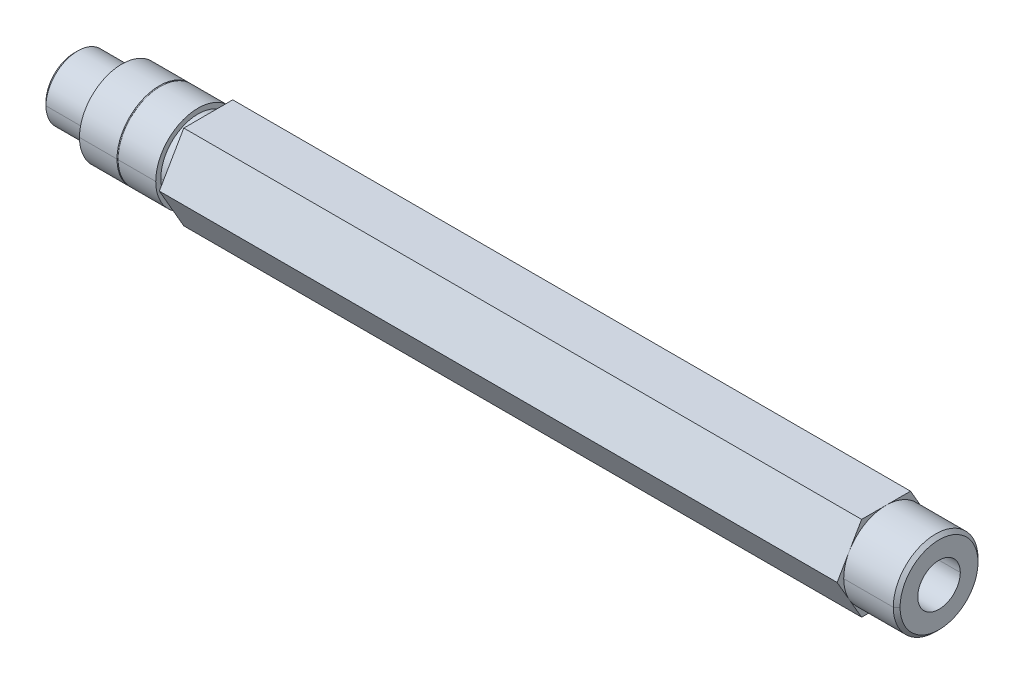
ISO-10303-21;
HEADER;
FILE_DESCRIPTION(('STEP AP214'),'2;1');
FILE_NAME('part.step','',(''),(''),'','','');
FILE_SCHEMA(('AUTOMOTIVE_DESIGN { 1 0 10303 214 1 1 1 1 }'));
ENDSEC;
DATA;
#1=APPLICATION_CONTEXT('core data for automotive mechanical design processes');
#2=APPLICATION_PROTOCOL_DEFINITION('international standard','automotive_design',2000,#1);
#3=PRODUCT_CONTEXT('',#1,'mechanical');
#4=PRODUCT('Part','Part','',(#3));
#5=PRODUCT_RELATED_PRODUCT_CATEGORY('part','',(#4));
#6=PRODUCT_DEFINITION_FORMATION('','',#4);
#7=PRODUCT_DEFINITION_CONTEXT('part definition',#1,'design');
#8=PRODUCT_DEFINITION('design','',#6,#7);
#9=PRODUCT_DEFINITION_SHAPE('','',#8);
#10=(LENGTH_UNIT() NAMED_UNIT(*) SI_UNIT(.MILLI.,.METRE.));
#11=(NAMED_UNIT(*) PLANE_ANGLE_UNIT() SI_UNIT($,.RADIAN.));
#12=(NAMED_UNIT(*) SI_UNIT($,.STERADIAN.) SOLID_ANGLE_UNIT());
#13=UNCERTAINTY_MEASURE_WITH_UNIT(LENGTH_MEASURE(1.E-05),#10,'distance_accuracy_value','');
#14=(GEOMETRIC_REPRESENTATION_CONTEXT(3) GLOBAL_UNCERTAINTY_ASSIGNED_CONTEXT((#13)) GLOBAL_UNIT_ASSIGNED_CONTEXT((#10,
#11,#12)) REPRESENTATION_CONTEXT('',''));
#15=CARTESIAN_POINT('',(0.,0.,0.));
#16=DIRECTION('',(0.,0.,1.));
#17=DIRECTION('',(1.,0.,0.));
#18=AXIS2_PLACEMENT_3D('',#15,#16,#17);
#19=CARTESIAN_POINT('',(18.542,0.,0.));
#20=DIRECTION('',(-1.,0.,0.));
#21=DIRECTION('',(0.,0.,1.));
#22=AXIS2_PLACEMENT_3D('',#19,#20,#21);
#23=CYLINDRICAL_SURFACE('',#22,6.35);
#24=DIRECTION('',(-1.,0.,0.));
#25=VECTOR('',#24,1.);
#26=CARTESIAN_POINT('',(18.542,0.,-6.35));
#27=LINE('',#26,#25);
#28=CARTESIAN_POINT('',(12.7381,0.,-6.35));
#29=VERTEX_POINT('',#28);
#30=CARTESIAN_POINT('',(7.112,0.,-6.35));
#31=VERTEX_POINT('',#30);
#32=EDGE_CURVE('E280',#29,#31,#27,.T.);
#33=ORIENTED_EDGE('',*,*,#32,.F.);
#34=CARTESIAN_POINT('',(12.7381,0.,0.));
#35=DIRECTION('',(1.,0.,0.));
#36=DIRECTION('',(0.,0.,-1.));
#37=AXIS2_PLACEMENT_3D('',#34,#35,#36);
#38=CIRCLE('',#37,6.35);
#39=CARTESIAN_POINT('',(12.7381,0.,6.35));
#40=VERTEX_POINT('',#39);
#41=EDGE_CURVE('E277',#40,#29,#38,.T.);
#42=ORIENTED_EDGE('',*,*,#41,.F.);
#43=DIRECTION('',(-1.,0.,0.));
#44=VECTOR('',#43,1.);
#45=CARTESIAN_POINT('',(18.542,0.,6.35));
#46=LINE('',#45,#44);
#47=CARTESIAN_POINT('',(7.112,0.,6.35));
#48=VERTEX_POINT('',#47);
#49=EDGE_CURVE('E265',#40,#48,#46,.T.);
#50=ORIENTED_EDGE('',*,*,#49,.T.);
#51=CARTESIAN_POINT('',(7.112,0.,0.));
#52=DIRECTION('',(1.,0.,0.));
#53=DIRECTION('',(0.,0.,-1.));
#54=AXIS2_PLACEMENT_3D('',#51,#52,#53);
#55=CIRCLE('',#54,6.35);
#56=EDGE_CURVE('E11',#48,#31,#55,.T.);
#57=ORIENTED_EDGE('',*,*,#56,.T.);
#58=EDGE_LOOP('',(#33,#42,#50,#57));
#59=FACE_BOUND('',#58,.T.);
#60=ADVANCED_FACE('F16',(#59),#23,.T.);
#61=CARTESIAN_POINT('',(7.112,0.,0.));
#62=DIRECTION('',(1.,0.,0.));
#63=DIRECTION('',(0.,1.,0.));
#64=AXIS2_PLACEMENT_3D('',#61,#62,#63);
#65=PLANE('',#64);
#66=CARTESIAN_POINT('',(7.112,0.,0.));
#67=DIRECTION('',(1.,0.,0.));
#68=DIRECTION('',(0.,0.,-1.));
#69=AXIS2_PLACEMENT_3D('',#66,#67,#68);
#70=CIRCLE('',#69,4.7625);
#71=CARTESIAN_POINT('',(7.112,0.,4.7625));
#72=VERTEX_POINT('',#71);
#73=CARTESIAN_POINT('',(7.112,0.,-4.7625));
#74=VERTEX_POINT('',#73);
#75=EDGE_CURVE('E27',#72,#74,#70,.T.);
#76=ORIENTED_EDGE('',*,*,#75,.T.);
#77=CARTESIAN_POINT('',(7.112,0.,0.));
#78=DIRECTION('',(1.,0.,0.));
#79=DIRECTION('',(0.,0.,-1.));
#80=AXIS2_PLACEMENT_3D('',#77,#78,#79);
#81=CIRCLE('',#80,4.7625);
#82=EDGE_CURVE('E272',#74,#72,#81,.T.);
#83=ORIENTED_EDGE('',*,*,#82,.T.);
#84=EDGE_LOOP('',(#76,#83));
#85=FACE_BOUND('',#84,.T.);
#86=ORIENTED_EDGE('',*,*,#56,.F.);
#87=CARTESIAN_POINT('',(7.112,0.,0.));
#88=DIRECTION('',(1.,0.,0.));
#89=DIRECTION('',(0.,0.,-1.));
#90=AXIS2_PLACEMENT_3D('',#87,#88,#89);
#91=CIRCLE('',#90,6.35);
#92=EDGE_CURVE('E269',#31,#48,#91,.T.);
#93=ORIENTED_EDGE('',*,*,#92,.F.);
#94=EDGE_LOOP('',(#86,#93));
#95=FACE_BOUND('',#94,.T.);
#96=ADVANCED_FACE('F628',(#85,#95),#65,.F.);
#97=CARTESIAN_POINT('',(7.112,0.,0.));
#98=DIRECTION('',(-1.,0.,0.));
#99=DIRECTION('',(0.,0.,1.));
#100=AXIS2_PLACEMENT_3D('',#97,#98,#99);
#101=CYLINDRICAL_SURFACE('',#100,4.7625);
#102=DIRECTION('',(-1.,0.,0.));
#103=VECTOR('',#102,1.);
#104=CARTESIAN_POINT('',(7.112,0.,-4.7625));
#105=LINE('',#104,#103);
#106=CARTESIAN_POINT('',(0.50800000000003,0.,-4.7625));
#107=VERTEX_POINT('',#106);
#108=EDGE_CURVE('E350',#74,#107,#105,.T.);
#109=ORIENTED_EDGE('',*,*,#108,.F.);
#110=ORIENTED_EDGE('',*,*,#75,.F.);
#111=DIRECTION('',(-1.,0.,0.));
#112=VECTOR('',#111,1.);
#113=CARTESIAN_POINT('',(7.112,0.,4.7625));
#114=LINE('',#113,#112);
#115=CARTESIAN_POINT('',(0.50800000000003,0.,4.7625));
#116=VERTEX_POINT('',#115);
#117=EDGE_CURVE('E344',#72,#116,#114,.T.);
#118=ORIENTED_EDGE('',*,*,#117,.T.);
#119=CARTESIAN_POINT('',(0.50800000000003,0.,0.));
#120=DIRECTION('',(1.,0.,0.));
#121=DIRECTION('',(0.,0.,-1.));
#122=AXIS2_PLACEMENT_3D('',#119,#120,#121);
#123=CIRCLE('',#122,4.7625);
#124=EDGE_CURVE('E313',#116,#107,#123,.T.);
#125=ORIENTED_EDGE('',*,*,#124,.T.);
#126=EDGE_LOOP('',(#109,#110,#118,#125));
#127=FACE_BOUND('',#126,.T.);
#128=ADVANCED_FACE('F633',(#127),#101,.T.);
#129=CARTESIAN_POINT('',(0.50800000000003,0.,0.));
#130=DIRECTION('',(1.,0.,0.));
#131=DIRECTION('',(0.,0.,-1.));
#132=AXIS2_PLACEMENT_3D('',#129,#130,#131);
#133=CONICAL_SURFACE('',#132,4.7625,0.785398163397452);
#134=DIRECTION('',(0.707106781186545,0.,0.70710678118655));
#135=VECTOR('',#134,1.);
#136=CARTESIAN_POINT('',(0.50800000000003,0.,4.7625));
#137=LINE('',#136,#135);
#138=CARTESIAN_POINT('',(0.,0.,4.2545));
#139=VERTEX_POINT('',#138);
#140=EDGE_CURVE('E322',#139,#116,#137,.T.);
#141=ORIENTED_EDGE('',*,*,#140,.F.);
#142=CARTESIAN_POINT('',(0.,0.,0.));
#143=DIRECTION('',(-1.,0.,0.));
#144=DIRECTION('',(0.,0.,-1.));
#145=AXIS2_PLACEMENT_3D('',#142,#143,#144);
#146=CIRCLE('',#145,4.2545);
#147=CARTESIAN_POINT('',(0.,0.,-4.2545));
#148=VERTEX_POINT('',#147);
#149=EDGE_CURVE('E378',#148,#139,#146,.T.);
#150=ORIENTED_EDGE('',*,*,#149,.F.);
#151=DIRECTION('',(0.707106781186545,0.,-0.70710678118655));
#152=VECTOR('',#151,1.);
#153=CARTESIAN_POINT('',(0.50800000000003,0.,-4.7625));
#154=LINE('',#153,#152);
#155=EDGE_CURVE('E330',#148,#107,#154,.T.);
#156=ORIENTED_EDGE('',*,*,#155,.T.);
#157=ORIENTED_EDGE('',*,*,#124,.F.);
#158=EDGE_LOOP('',(#141,#150,#156,#157));
#159=FACE_BOUND('',#158,.T.);
#160=ADVANCED_FACE('F644',(#159),#133,.T.);
#161=CARTESIAN_POINT('',(0.,0.,0.));
#162=DIRECTION('',(1.,0.,0.));
#163=DIRECTION('',(0.,1.,0.));
#164=AXIS2_PLACEMENT_3D('',#161,#162,#163);
#165=PLANE('',#164);
#166=CARTESIAN_POINT('',(0.,0.,0.));
#167=DIRECTION('',(-1.,0.,0.));
#168=DIRECTION('',(0.,0.,1.));
#169=AXIS2_PLACEMENT_3D('',#166,#167,#168);
#170=CIRCLE('',#169,3.1877);
#171=CARTESIAN_POINT('',(0.,0.,3.1877));
#172=VERTEX_POINT('',#171);
#173=CARTESIAN_POINT('',(0.,0.,-3.1877));
#174=VERTEX_POINT('',#173);
#175=EDGE_CURVE('E381',#172,#174,#170,.T.);
#176=ORIENTED_EDGE('',*,*,#175,.F.);
#177=CARTESIAN_POINT('',(0.,0.,0.));
#178=DIRECTION('',(-1.,0.,0.));
#179=DIRECTION('',(0.,0.,1.));
#180=AXIS2_PLACEMENT_3D('',#177,#178,#179);
#181=CIRCLE('',#180,3.1877);
#182=EDGE_CURVE('E426',#174,#172,#181,.T.);
#183=ORIENTED_EDGE('',*,*,#182,.F.);
#184=EDGE_LOOP('',(#176,#183));
#185=FACE_BOUND('',#184,.T.);
#186=ORIENTED_EDGE('',*,*,#149,.T.);
#187=CARTESIAN_POINT('',(0.,0.,0.));
#188=DIRECTION('',(-1.,0.,0.));
#189=DIRECTION('',(0.,0.,-1.));
#190=AXIS2_PLACEMENT_3D('',#187,#188,#189);
#191=CIRCLE('',#190,4.2545);
#192=EDGE_CURVE('E327',#139,#148,#191,.T.);
#193=ORIENTED_EDGE('',*,*,#192,.T.);
#194=EDGE_LOOP('',(#186,#193));
#195=FACE_BOUND('',#194,.T.);
#196=ADVANCED_FACE('F18',(#185,#195),#165,.F.);
#197=CARTESIAN_POINT('',(0.,0.,0.));
#198=DIRECTION('',(-1.,0.,0.));
#199=DIRECTION('',(0.,0.,1.));
#200=AXIS2_PLACEMENT_3D('',#197,#198,#199);
#201=CYLINDRICAL_SURFACE('',#200,3.1877);
#202=DIRECTION('',(-1.,0.,0.));
#203=VECTOR('',#202,1.);
#204=CARTESIAN_POINT('',(0.,0.,-3.1877));
#205=LINE('',#204,#203);
#206=CARTESIAN_POINT('',(12.7,0.,-3.1877));
#207=VERTEX_POINT('',#206);
#208=EDGE_CURVE('E425',#207,#174,#205,.T.);
#209=ORIENTED_EDGE('',*,*,#208,.F.);
#210=CARTESIAN_POINT('',(12.7,0.,0.));
#211=DIRECTION('',(-1.,0.,0.));
#212=DIRECTION('',(0.,0.,1.));
#213=AXIS2_PLACEMENT_3D('',#210,#211,#212);
#214=CIRCLE('',#213,3.1877);
#215=CARTESIAN_POINT('',(12.7,0.,3.1877));
#216=VERTEX_POINT('',#215);
#217=EDGE_CURVE('E593',#216,#207,#214,.T.);
#218=ORIENTED_EDGE('',*,*,#217,.F.);
#219=DIRECTION('',(-1.,0.,0.));
#220=VECTOR('',#219,1.);
#221=CARTESIAN_POINT('',(0.,0.,3.1877));
#222=LINE('',#221,#220);
#223=EDGE_CURVE('E433',#216,#172,#222,.T.);
#224=ORIENTED_EDGE('',*,*,#223,.T.);
#225=ORIENTED_EDGE('',*,*,#175,.T.);
#226=EDGE_LOOP('',(#209,#218,#224,#225));
#227=FACE_BOUND('',#226,.T.);
#228=ADVANCED_FACE('F602',(#227),#201,.F.);
#229=CARTESIAN_POINT('',(12.7,0.,0.));
#230=DIRECTION('',(-1.,0.,0.));
#231=DIRECTION('',(0.,0.,1.));
#232=AXIS2_PLACEMENT_3D('',#229,#230,#231);
#233=CONICAL_SURFACE('',#232,3.1877,1.02974425867665);
#234=DIRECTION('',(-0.515038074910055,0.,-0.857167300702112));
#235=VECTOR('',#234,1.);
#236=CARTESIAN_POINT('',(12.7,0.,-3.1877));
#237=LINE('',#236,#235);
#238=CARTESIAN_POINT('',(14.6153633952742,0.,0.));
#239=VERTEX_POINT('',#238);
#240=EDGE_CURVE('E416',#239,#207,#237,.T.);
#241=ORIENTED_EDGE('',*,*,#240,.F.);
#242=DIRECTION('',(-0.515038074910055,0.,0.857167300702112));
#243=VECTOR('',#242,1.);
#244=CARTESIAN_POINT('',(12.7,0.,3.1877));
#245=LINE('',#244,#243);
#246=EDGE_CURVE('E440',#239,#216,#245,.T.);
#247=ORIENTED_EDGE('',*,*,#246,.T.);
#248=ORIENTED_EDGE('',*,*,#217,.T.);
#249=EDGE_LOOP('',(#241,#247,#248));
#250=FACE_BOUND('',#249,.T.);
#251=ADVANCED_FACE('F613',(#250),#233,.F.);
#252=CARTESIAN_POINT('',(12.827,0.,0.));
#253=DIRECTION('',(-1.,0.,0.));
#254=DIRECTION('',(0.,0.,1.));
#255=AXIS2_PLACEMENT_3D('',#252,#253,#254);
#256=TOROIDAL_SURFACE('',#255,6.35,0.0889);
#257=CARTESIAN_POINT('',(12.827,0.,0.));
#258=DIRECTION('',(-1.,0.,0.));
#259=DIRECTION('',(0.,0.,1.));
#260=AXIS2_PLACEMENT_3D('',#257,#258,#259);
#261=CIRCLE('',#260,6.2611);
#262=CARTESIAN_POINT('',(12.827,0.,6.2611));
#263=VERTEX_POINT('',#262);
#264=CARTESIAN_POINT('',(12.827,0.,-6.2611));
#265=VERTEX_POINT('',#264);
#266=EDGE_CURVE('E300',#263,#265,#261,.T.);
#267=ORIENTED_EDGE('',*,*,#266,.F.);
#268=CARTESIAN_POINT('',(12.827,0.,6.35));
#269=DIRECTION('',(0.,-1.,0.));
#270=DIRECTION('',(0.,0.,-1.));
#271=AXIS2_PLACEMENT_3D('',#268,#269,#270);
#272=CIRCLE('',#271,0.0889);
#273=CARTESIAN_POINT('',(12.9159,0.,6.35));
#274=VERTEX_POINT('',#273);
#275=EDGE_CURVE('E455',#263,#274,#272,.T.);
#276=ORIENTED_EDGE('',*,*,#275,.T.);
#277=CARTESIAN_POINT('',(12.9159,0.,0.));
#278=DIRECTION('',(-1.,0.,0.));
#279=DIRECTION('',(0.,0.,1.));
#280=AXIS2_PLACEMENT_3D('',#277,#278,#279);
#281=CIRCLE('',#280,6.35);
#282=CARTESIAN_POINT('',(12.9159,0.,-6.35));
#283=VERTEX_POINT('',#282);
#284=EDGE_CURVE('E415',#274,#283,#281,.T.);
#285=ORIENTED_EDGE('',*,*,#284,.T.);
#286=CARTESIAN_POINT('',(12.827,0.,-6.35));
#287=DIRECTION('',(0.,1.,0.));
#288=DIRECTION('',(0.,0.,1.));
#289=AXIS2_PLACEMENT_3D('',#286,#287,#288);
#290=CIRCLE('',#289,0.0889);
#291=EDGE_CURVE('E414',#265,#283,#290,.T.);
#292=ORIENTED_EDGE('',*,*,#291,.F.);
#293=EDGE_LOOP('',(#267,#276,#285,#292));
#294=FACE_BOUND('',#293,.T.);
#295=ADVANCED_FACE('F616',(#294),#256,.F.);
#296=CARTESIAN_POINT('',(129.6035,0.,0.));
#297=DIRECTION('',(1.,0.,0.));
#298=DIRECTION('',(0.,0.,-1.));
#299=AXIS2_PLACEMENT_3D('',#296,#297,#298);
#300=CYLINDRICAL_SURFACE('',#299,3.1877);
#301=DIRECTION('',(1.,0.,0.));
#302=VECTOR('',#301,1.);
#303=CARTESIAN_POINT('',(129.6035,0.,3.1877));
#304=LINE('',#303,#302);
#305=CARTESIAN_POINT('',(116.9035,0.,3.1877));
#306=VERTEX_POINT('',#305);
#307=CARTESIAN_POINT('',(129.6035,0.,3.1877));
#308=VERTEX_POINT('',#307);
#309=EDGE_CURVE('E466',#306,#308,#304,.T.);
#310=ORIENTED_EDGE('',*,*,#309,.F.);
#311=CARTESIAN_POINT('',(116.9035,0.,0.));
#312=DIRECTION('',(1.,0.,0.));
#313=DIRECTION('',(0.,0.,-1.));
#314=AXIS2_PLACEMENT_3D('',#311,#312,#313);
#315=CIRCLE('',#314,3.1877);
#316=CARTESIAN_POINT('',(116.9035,0.,-3.1877));
#317=VERTEX_POINT('',#316);
#318=EDGE_CURVE('E20',#317,#306,#315,.T.);
#319=ORIENTED_EDGE('',*,*,#318,.F.);
#320=DIRECTION('',(1.,0.,0.));
#321=VECTOR('',#320,1.);
#322=CARTESIAN_POINT('',(129.6035,0.,-3.1877));
#323=LINE('',#322,#321);
#324=CARTESIAN_POINT('',(129.6035,0.,-3.1877));
#325=VERTEX_POINT('',#324);
#326=EDGE_CURVE('E481',#317,#325,#323,.T.);
#327=ORIENTED_EDGE('',*,*,#326,.T.);
#328=CARTESIAN_POINT('',(129.6035,0.,0.));
#329=DIRECTION('',(1.,0.,0.));
#330=DIRECTION('',(0.,0.,-1.));
#331=AXIS2_PLACEMENT_3D('',#328,#329,#330);
#332=CIRCLE('',#331,3.1877);
#333=EDGE_CURVE('E459',#325,#308,#332,.T.);
#334=ORIENTED_EDGE('',*,*,#333,.T.);
#335=EDGE_LOOP('',(#310,#319,#327,#334));
#336=FACE_BOUND('',#335,.T.);
#337=ADVANCED_FACE('F623',(#336),#300,.F.);
#338=CARTESIAN_POINT('',(116.9035,0.,0.));
#339=DIRECTION('',(1.,0.,0.));
#340=DIRECTION('',(0.,0.,-1.));
#341=AXIS2_PLACEMENT_3D('',#338,#339,#340);
#342=CONICAL_SURFACE('',#341,3.1877,1.02974425867665);
#343=DIRECTION('',(0.515038074910054,0.,0.857167300702112));
#344=VECTOR('',#343,1.);
#345=CARTESIAN_POINT('',(116.9035,0.,3.1877));
#346=LINE('',#345,#344);
#347=CARTESIAN_POINT('',(114.988136604726,0.,0.));
#348=VERTEX_POINT('',#347);
#349=EDGE_CURVE('E372',#348,#306,#346,.T.);
#350=ORIENTED_EDGE('',*,*,#349,.F.);
#351=DIRECTION('',(0.515038074910054,0.,-0.857167300702112));
#352=VECTOR('',#351,1.);
#353=CARTESIAN_POINT('',(116.9035,0.,-3.1877));
#354=LINE('',#353,#352);
#355=EDGE_CURVE('E484',#348,#317,#354,.T.);
#356=ORIENTED_EDGE('',*,*,#355,.T.);
#357=ORIENTED_EDGE('',*,*,#318,.T.);
#358=EDGE_LOOP('',(#350,#356,#357));
#359=FACE_BOUND('',#358,.T.);
#360=ADVANCED_FACE('F744',(#359),#342,.F.);
#361=CARTESIAN_POINT('',(129.6035,0.,0.));
#362=DIRECTION('',(-1.,0.,0.));
#363=DIRECTION('',(0.,0.,1.));
#364=AXIS2_PLACEMENT_3D('',#361,#362,#363);
#365=CONICAL_SURFACE('',#364,5.842,0.785398163397453);
#366=DIRECTION('',(-0.707106781186544,0.,-0.707106781186551));
#367=VECTOR('',#366,1.);
#368=CARTESIAN_POINT('',(129.6035,0.,-5.842));
#369=LINE('',#368,#367);
#370=CARTESIAN_POINT('',(129.6035,0.,-5.842));
#371=VERTEX_POINT('',#370);
#372=CARTESIAN_POINT('',(129.0955,0.,-6.35));
#373=VERTEX_POINT('',#372);
#374=EDGE_CURVE('E373',#371,#373,#369,.T.);
#375=ORIENTED_EDGE('',*,*,#374,.F.);
#376=CARTESIAN_POINT('',(129.6035,0.,0.));
#377=DIRECTION('',(1.,0.,0.));
#378=DIRECTION('',(0.,0.,-1.));
#379=AXIS2_PLACEMENT_3D('',#376,#377,#378);
#380=CIRCLE('',#379,5.842);
#381=CARTESIAN_POINT('',(129.6035,0.,5.842));
#382=VERTEX_POINT('',#381);
#383=EDGE_CURVE('E462',#382,#371,#380,.T.);
#384=ORIENTED_EDGE('',*,*,#383,.F.);
#385=DIRECTION('',(-0.707106781186544,0.,0.707106781186551));
#386=VECTOR('',#385,1.);
#387=CARTESIAN_POINT('',(129.6035,0.,5.842));
#388=LINE('',#387,#386);
#389=CARTESIAN_POINT('',(129.0955,0.,6.35));
#390=VERTEX_POINT('',#389);
#391=EDGE_CURVE('E339',#382,#390,#388,.T.);
#392=ORIENTED_EDGE('',*,*,#391,.T.);
#393=CARTESIAN_POINT('',(129.0955,0.,0.));
#394=DIRECTION('',(-1.,0.,0.));
#395=DIRECTION('',(0.,0.,-1.));
#396=AXIS2_PLACEMENT_3D('',#393,#394,#395);
#397=CIRCLE('',#396,6.35);
#398=EDGE_CURVE('E303',#373,#390,#397,.T.);
#399=ORIENTED_EDGE('',*,*,#398,.F.);
#400=EDGE_LOOP('',(#375,#384,#392,#399));
#401=FACE_BOUND('',#400,.T.);
#402=ADVANCED_FACE('F738',(#401),#365,.T.);
#403=CARTESIAN_POINT('',(129.6035,0.,0.));
#404=DIRECTION('',(1.,0.,0.));
#405=DIRECTION('',(0.,1.,0.));
#406=AXIS2_PLACEMENT_3D('',#403,#404,#405);
#407=PLANE('',#406);
#408=ORIENTED_EDGE('',*,*,#333,.F.);
#409=CARTESIAN_POINT('',(129.6035,0.,0.));
#410=DIRECTION('',(1.,0.,0.));
#411=DIRECTION('',(0.,0.,-1.));
#412=AXIS2_PLACEMENT_3D('',#409,#410,#411);
#413=CIRCLE('',#412,3.1877);
#414=EDGE_CURVE('E480',#308,#325,#413,.T.);
#415=ORIENTED_EDGE('',*,*,#414,.F.);
#416=EDGE_LOOP('',(#408,#415));
#417=FACE_BOUND('',#416,.T.);
#418=ORIENTED_EDGE('',*,*,#383,.T.);
#419=CARTESIAN_POINT('',(129.6035,0.,0.));
#420=DIRECTION('',(1.,0.,0.));
#421=DIRECTION('',(0.,0.,-1.));
#422=AXIS2_PLACEMENT_3D('',#419,#420,#421);
#423=CIRCLE('',#422,5.842);
#424=EDGE_CURVE('E369',#371,#382,#423,.T.);
#425=ORIENTED_EDGE('',*,*,#424,.T.);
#426=EDGE_LOOP('',(#418,#425));
#427=FACE_BOUND('',#426,.T.);
#428=ADVANCED_FACE('F745',(#417,#427),#407,.T.);
#429=CARTESIAN_POINT('',(129.6035,0.,0.));
#430=DIRECTION('',(-1.,0.,0.));
#431=DIRECTION('',(0.,0.,1.));
#432=AXIS2_PLACEMENT_3D('',#429,#430,#431);
#433=CYLINDRICAL_SURFACE('',#432,6.35);
#434=DIRECTION('',(-1.,0.,0.));
#435=VECTOR('',#434,1.);
#436=CARTESIAN_POINT('',(129.6035,0.,-6.35));
#437=LINE('',#436,#435);
#438=CARTESIAN_POINT('',(121.666,0.,-6.35));
#439=VERTEX_POINT('',#438);
#440=EDGE_CURVE('E334',#373,#439,#437,.T.);
#441=ORIENTED_EDGE('',*,*,#440,.F.);
#442=ORIENTED_EDGE('',*,*,#398,.T.);
#443=DIRECTION('',(-1.,0.,0.));
#444=VECTOR('',#443,1.);
#445=CARTESIAN_POINT('',(129.6035,0.,6.35));
#446=LINE('',#445,#444);
#447=CARTESIAN_POINT('',(121.666,0.,6.35));
#448=VERTEX_POINT('',#447);
#449=EDGE_CURVE('E323',#390,#448,#446,.T.);
#450=ORIENTED_EDGE('',*,*,#449,.T.);
#451=CARTESIAN_POINT('',(121.666,0.,0.));
#452=DIRECTION('',(1.,0.,0.));
#453=DIRECTION('',(0.,0.,-1.));
#454=AXIS2_PLACEMENT_3D('',#451,#452,#453);
#455=CIRCLE('',#454,6.35);
#456=CARTESIAN_POINT('',(121.666,-3.175,5.49926131403118));
#457=VERTEX_POINT('',#456);
#458=EDGE_CURVE('E555',#448,#457,#455,.T.);
#459=ORIENTED_EDGE('',*,*,#458,.T.);
#460=CARTESIAN_POINT('',(121.666,0.,0.));
#461=DIRECTION('',(1.,0.,0.));
#462=DIRECTION('',(0.,0.,-1.));
#463=AXIS2_PLACEMENT_3D('',#460,#461,#462);
#464=CIRCLE('',#463,6.35);
#465=CARTESIAN_POINT('',(121.666,-6.35,0.));
#466=VERTEX_POINT('',#465);
#467=EDGE_CURVE('E556',#457,#466,#464,.T.);
#468=ORIENTED_EDGE('',*,*,#467,.T.);
#469=CARTESIAN_POINT('',(121.666,0.,0.));
#470=DIRECTION('',(1.,0.,0.));
#471=DIRECTION('',(0.,0.,-1.));
#472=AXIS2_PLACEMENT_3D('',#469,#470,#471);
#473=CIRCLE('',#472,6.35);
#474=CARTESIAN_POINT('',(121.666,-3.175,-5.49926131403119));
#475=VERTEX_POINT('',#474);
#476=EDGE_CURVE('E315',#466,#475,#473,.T.);
#477=ORIENTED_EDGE('',*,*,#476,.T.);
#478=CARTESIAN_POINT('',(121.666,0.,0.));
#479=DIRECTION('',(1.,0.,0.));
#480=DIRECTION('',(0.,0.,-1.));
#481=AXIS2_PLACEMENT_3D('',#478,#479,#480);
#482=CIRCLE('',#481,6.35);
#483=EDGE_CURVE('E500',#475,#439,#482,.T.);
#484=ORIENTED_EDGE('',*,*,#483,.T.);
#485=EDGE_LOOP('',(#441,#442,#450,#459,#468,#477,#484));
#486=FACE_BOUND('',#485,.T.);
#487=ADVANCED_FACE('F749',(#486),#433,.T.);
#488=CARTESIAN_POINT('',(121.666,0.,0.));
#489=DIRECTION('',(1.,0.,0.));
#490=DIRECTION('',(0.,1.,0.));
#491=AXIS2_PLACEMENT_3D('',#488,#489,#490);
#492=PLANE('',#491);
#493=ORIENTED_EDGE('',*,*,#483,.F.);
#494=DIRECTION('',(0.,0.866025403784439,-0.5));
#495=VECTOR('',#494,1.);
#496=CARTESIAN_POINT('',(121.666,-6.35,-3.66617420935412));
#497=LINE('',#496,#495);
#498=CARTESIAN_POINT('',(121.666,0.,-7.33234841870824));
#499=VERTEX_POINT('',#498);
#500=EDGE_CURVE('E393',#475,#499,#497,.T.);
#501=ORIENTED_EDGE('',*,*,#500,.T.);
#502=DIRECTION('',(0.,0.866025403784439,0.5));
#503=VECTOR('',#502,1.);
#504=CARTESIAN_POINT('',(121.666,0.,-7.33234841870824));
#505=LINE('',#504,#503);
#506=CARTESIAN_POINT('',(121.666,3.175,-5.49926131403118));
#507=VERTEX_POINT('',#506);
#508=EDGE_CURVE('E37',#499,#507,#505,.T.);
#509=ORIENTED_EDGE('',*,*,#508,.T.);
#510=CARTESIAN_POINT('',(121.666,0.,0.));
#511=DIRECTION('',(1.,0.,0.));
#512=DIRECTION('',(0.,0.,-1.));
#513=AXIS2_PLACEMENT_3D('',#510,#511,#512);
#514=CIRCLE('',#513,6.35);
#515=EDGE_CURVE('E337',#439,#507,#514,.T.);
#516=ORIENTED_EDGE('',*,*,#515,.F.);
#517=EDGE_LOOP('',(#493,#501,#509,#516));
#518=FACE_BOUND('',#517,.T.);
#519=ADVANCED_FACE('F747',(#518),#492,.T.);
#520=CARTESIAN_POINT('',(121.666,-6.35,3.66617420935412));
#521=DIRECTION('',(0.,1.,0.));
#522=DIRECTION('',(0.,0.,-1.));
#523=AXIS2_PLACEMENT_3D('',#520,#521,#522);
#524=PLANE('',#523);
#525=DIRECTION('',(0.,0.,-1.));
#526=VECTOR('',#525,1.);
#527=CARTESIAN_POINT('',(20.066,-6.35,3.66617420935412));
#528=LINE('',#527,#526);
#529=CARTESIAN_POINT('',(20.066,-6.35,3.66617420935412));
#530=VERTEX_POINT('',#529);
#531=CARTESIAN_POINT('',(20.066,-6.35,-3.66617420935412));
#532=VERTEX_POINT('',#531);
#533=EDGE_CURVE('E399',#530,#532,#528,.T.);
#534=ORIENTED_EDGE('',*,*,#533,.T.);
#535=DIRECTION('',(-1.,0.,0.));
#536=VECTOR('',#535,1.);
#537=CARTESIAN_POINT('',(121.666,-6.35,-3.66617420935412));
#538=LINE('',#537,#536);
#539=CARTESIAN_POINT('',(121.666,-6.35,-3.66617420935412));
#540=VERTEX_POINT('',#539);
#541=EDGE_CURVE('E391',#540,#532,#538,.T.);
#542=ORIENTED_EDGE('',*,*,#541,.F.);
#543=DIRECTION('',(0.,0.,-1.));
#544=VECTOR('',#543,1.);
#545=CARTESIAN_POINT('',(121.666,-6.35,3.66617420935412));
#546=LINE('',#545,#544);
#547=EDGE_CURVE('E316',#466,#540,#546,.T.);
#548=ORIENTED_EDGE('',*,*,#547,.F.);
#549=DIRECTION('',(0.,0.,-1.));
#550=VECTOR('',#549,1.);
#551=CARTESIAN_POINT('',(121.666,-6.35,3.66617420935412));
#552=LINE('',#551,#550);
#553=CARTESIAN_POINT('',(121.666,-6.35,3.66617420935412));
#554=VERTEX_POINT('',#553);
#555=EDGE_CURVE('E320',#554,#466,#552,.T.);
#556=ORIENTED_EDGE('',*,*,#555,.F.);
#557=DIRECTION('',(-1.,0.,0.));
#558=VECTOR('',#557,1.);
#559=CARTESIAN_POINT('',(121.666,-6.35,3.66617420935412));
#560=LINE('',#559,#558);
#561=EDGE_CURVE('E498',#554,#530,#560,.T.);
#562=ORIENTED_EDGE('',*,*,#561,.T.);
#563=EDGE_LOOP('',(#534,#542,#548,#556,#562));
#564=FACE_BOUND('',#563,.T.);
#565=ADVANCED_FACE('F740',(#564),#524,.F.);
#566=CARTESIAN_POINT('',(121.666,0.,7.33234841870824));
#567=DIRECTION('',(0.,0.5,-0.866025403784438));
#568=DIRECTION('',(-1.,0.,0.));
#569=AXIS2_PLACEMENT_3D('',#566,#567,#568);
#570=PLANE('',#569);
#571=DIRECTION('',(0.,-0.866025403784439,-0.5));
#572=VECTOR('',#571,1.);
#573=CARTESIAN_POINT('',(20.066,0.,7.33234841870824));
#574=LINE('',#573,#572);
#575=CARTESIAN_POINT('',(20.066,0.,7.33234841870824));
#576=VERTEX_POINT('',#575);
#577=EDGE_CURVE('E395',#576,#530,#574,.T.);
#578=ORIENTED_EDGE('',*,*,#577,.T.);
#579=ORIENTED_EDGE('',*,*,#561,.F.);
#580=DIRECTION('',(0.,-0.866025403784439,-0.5));
#581=VECTOR('',#580,1.);
#582=CARTESIAN_POINT('',(121.666,0.,7.33234841870824));
#583=LINE('',#582,#581);
#584=EDGE_CURVE('E447',#457,#554,#583,.T.);
#585=ORIENTED_EDGE('',*,*,#584,.F.);
#586=DIRECTION('',(0.,-0.866025403784439,-0.5));
#587=VECTOR('',#586,1.);
#588=CARTESIAN_POINT('',(121.666,0.,7.33234841870824));
#589=LINE('',#588,#587);
#590=CARTESIAN_POINT('',(121.666,0.,7.33234841870824));
#591=VERTEX_POINT('',#590);
#592=EDGE_CURVE('E547',#591,#457,#589,.T.);
#593=ORIENTED_EDGE('',*,*,#592,.F.);
#594=DIRECTION('',(-1.,0.,0.));
#595=VECTOR('',#594,1.);
#596=CARTESIAN_POINT('',(121.666,0.,7.33234841870824));
#597=LINE('',#596,#595);
#598=EDGE_CURVE('E573',#591,#576,#597,.T.);
#599=ORIENTED_EDGE('',*,*,#598,.T.);
#600=EDGE_LOOP('',(#578,#579,#585,#593,#599));
#601=FACE_BOUND('',#600,.T.);
#602=ADVANCED_FACE('F733',(#601),#570,.F.);
#603=CARTESIAN_POINT('',(121.666,6.35,3.66617420935412));
#604=DIRECTION('',(0.,-0.5,-0.866025403784439));
#605=DIRECTION('',(0.,-0.866025403784439,0.5));
#606=AXIS2_PLACEMENT_3D('',#603,#604,#605);
#607=PLANE('',#606);
#608=DIRECTION('',(0.,-0.866025403784439,0.5));
#609=VECTOR('',#608,1.);
#610=CARTESIAN_POINT('',(20.066,6.35,3.66617420935412));
#611=LINE('',#610,#609);
#612=CARTESIAN_POINT('',(20.066,6.35,3.66617420935412));
#613=VERTEX_POINT('',#612);
#614=EDGE_CURVE('E397',#613,#576,#611,.T.);
#615=ORIENTED_EDGE('',*,*,#614,.T.);
#616=ORIENTED_EDGE('',*,*,#598,.F.);
#617=DIRECTION('',(0.,-0.866025403784439,0.5));
#618=VECTOR('',#617,1.);
#619=CARTESIAN_POINT('',(121.666,6.35,3.66617420935412));
#620=LINE('',#619,#618);
#621=CARTESIAN_POINT('',(121.666,3.175,5.49926131403119));
#622=VERTEX_POINT('',#621);
#623=EDGE_CURVE('E384',#622,#591,#620,.T.);
#624=ORIENTED_EDGE('',*,*,#623,.F.);
#625=DIRECTION('',(0.,-0.866025403784439,0.5));
#626=VECTOR('',#625,1.);
#627=CARTESIAN_POINT('',(121.666,6.35,3.66617420935412));
#628=LINE('',#627,#626);
#629=CARTESIAN_POINT('',(121.666,6.35,3.66617420935412));
#630=VERTEX_POINT('',#629);
#631=EDGE_CURVE('E385',#630,#622,#628,.T.);
#632=ORIENTED_EDGE('',*,*,#631,.F.);
#633=DIRECTION('',(-1.,0.,0.));
#634=VECTOR('',#633,1.);
#635=CARTESIAN_POINT('',(121.666,6.35,3.66617420935412));
#636=LINE('',#635,#634);
#637=EDGE_CURVE('E335',#630,#613,#636,.T.);
#638=ORIENTED_EDGE('',*,*,#637,.T.);
#639=EDGE_LOOP('',(#615,#616,#624,#632,#638));
#640=FACE_BOUND('',#639,.T.);
#641=ADVANCED_FACE('F727',(#640),#607,.F.);
#642=CARTESIAN_POINT('',(121.666,6.35,-3.66617420935412));
#643=DIRECTION('',(0.,-1.,0.));
#644=DIRECTION('',(0.,0.,-1.));
#645=AXIS2_PLACEMENT_3D('',#642,#643,#644);
#646=PLANE('',#645);
#647=DIRECTION('',(0.,0.,1.));
#648=VECTOR('',#647,1.);
#649=CARTESIAN_POINT('',(20.066,6.35,-3.66617420935412));
#650=LINE('',#649,#648);
#651=CARTESIAN_POINT('',(20.066,6.35,-3.66617420935412));
#652=VERTEX_POINT('',#651);
#653=EDGE_CURVE('E579',#652,#613,#650,.T.);
#654=ORIENTED_EDGE('',*,*,#653,.T.);
#655=ORIENTED_EDGE('',*,*,#637,.F.);
#656=DIRECTION('',(0.,0.,1.));
#657=VECTOR('',#656,1.);
#658=CARTESIAN_POINT('',(121.666,6.35,-3.66617420935412));
#659=LINE('',#658,#657);
#660=CARTESIAN_POINT('',(121.666,6.35,0.));
#661=VERTEX_POINT('',#660);
#662=EDGE_CURVE('E387',#661,#630,#659,.T.);
#663=ORIENTED_EDGE('',*,*,#662,.F.);
#664=DIRECTION('',(0.,0.,1.));
#665=VECTOR('',#664,1.);
#666=CARTESIAN_POINT('',(121.666,6.35,-3.66617420935412));
#667=LINE('',#666,#665);
#668=CARTESIAN_POINT('',(121.666,6.35,-3.66617420935412));
#669=VERTEX_POINT('',#668);
#670=EDGE_CURVE('E536',#669,#661,#667,.T.);
#671=ORIENTED_EDGE('',*,*,#670,.F.);
#672=DIRECTION('',(-1.,0.,0.));
#673=VECTOR('',#672,1.);
#674=CARTESIAN_POINT('',(121.666,6.35,-3.66617420935412));
#675=LINE('',#674,#673);
#676=EDGE_CURVE('E51',#669,#652,#675,.T.);
#677=ORIENTED_EDGE('',*,*,#676,.T.);
#678=EDGE_LOOP('',(#654,#655,#663,#671,#677));
#679=FACE_BOUND('',#678,.T.);
#680=ADVANCED_FACE('F730',(#679),#646,.F.);
#681=CARTESIAN_POINT('',(121.666,0.,-7.33234841870824));
#682=DIRECTION('',(0.,-0.5,0.866025403784438));
#683=DIRECTION('',(-1.,0.,0.));
#684=AXIS2_PLACEMENT_3D('',#681,#682,#683);
#685=PLANE('',#684);
#686=DIRECTION('',(0.,0.866025403784439,0.5));
#687=VECTOR('',#686,1.);
#688=CARTESIAN_POINT('',(20.066,0.,-7.33234841870824));
#689=LINE('',#688,#687);
#690=CARTESIAN_POINT('',(20.066,0.,-7.33234841870824));
#691=VERTEX_POINT('',#690);
#692=EDGE_CURVE('E583',#691,#652,#689,.T.);
#693=ORIENTED_EDGE('',*,*,#692,.T.);
#694=ORIENTED_EDGE('',*,*,#676,.F.);
#695=DIRECTION('',(0.,0.866025403784439,0.5));
#696=VECTOR('',#695,1.);
#697=CARTESIAN_POINT('',(121.666,0.,-7.33234841870824));
#698=LINE('',#697,#696);
#699=EDGE_CURVE('E535',#507,#669,#698,.T.);
#700=ORIENTED_EDGE('',*,*,#699,.F.);
#701=ORIENTED_EDGE('',*,*,#508,.F.);
#702=DIRECTION('',(-1.,0.,0.));
#703=VECTOR('',#702,1.);
#704=CARTESIAN_POINT('',(121.666,0.,-7.33234841870824));
#705=LINE('',#704,#703);
#706=EDGE_CURVE('E585',#499,#691,#705,.T.);
#707=ORIENTED_EDGE('',*,*,#706,.T.);
#708=EDGE_LOOP('',(#693,#694,#700,#701,#707));
#709=FACE_BOUND('',#708,.T.);
#710=ADVANCED_FACE('F724',(#709),#685,.F.);
#711=CARTESIAN_POINT('',(121.666,-6.35,-3.66617420935412));
#712=DIRECTION('',(0.,0.5,0.866025403784439));
#713=DIRECTION('',(1.,0.,0.));
#714=AXIS2_PLACEMENT_3D('',#711,#712,#713);
#715=PLANE('',#714);
#716=DIRECTION('',(0.,0.866025403784439,-0.5));
#717=VECTOR('',#716,1.);
#718=CARTESIAN_POINT('',(20.066,-6.35,-3.66617420935412));
#719=LINE('',#718,#717);
#720=EDGE_CURVE('E347',#532,#691,#719,.T.);
#721=ORIENTED_EDGE('',*,*,#720,.T.);
#722=ORIENTED_EDGE('',*,*,#706,.F.);
#723=ORIENTED_EDGE('',*,*,#500,.F.);
#724=DIRECTION('',(0.,0.866025403784439,-0.5));
#725=VECTOR('',#724,1.);
#726=CARTESIAN_POINT('',(121.666,-6.35,-3.66617420935412));
#727=LINE('',#726,#725);
#728=EDGE_CURVE('E471',#540,#475,#727,.T.);
#729=ORIENTED_EDGE('',*,*,#728,.F.);
#730=ORIENTED_EDGE('',*,*,#541,.T.);
#731=EDGE_LOOP('',(#721,#722,#723,#729,#730));
#732=FACE_BOUND('',#731,.T.);
#733=ADVANCED_FACE('F716',(#732),#715,.F.);
#734=CARTESIAN_POINT('',(20.066,0.,0.));
#735=DIRECTION('',(1.,0.,0.));
#736=DIRECTION('',(0.,1.,0.));
#737=AXIS2_PLACEMENT_3D('',#734,#735,#736);
#738=PLANE('',#737);
#739=CARTESIAN_POINT('',(20.066,0.,0.));
#740=DIRECTION('',(1.,0.,0.));
#741=DIRECTION('',(0.,0.,-1.));
#742=AXIS2_PLACEMENT_3D('',#739,#740,#741);
#743=CIRCLE('',#742,5.588);
#744=CARTESIAN_POINT('',(20.066,0.,5.588));
#745=VERTEX_POINT('',#744);
#746=CARTESIAN_POINT('',(20.066,0.,-5.588));
#747=VERTEX_POINT('',#746);
#748=EDGE_CURVE('E346',#745,#747,#743,.T.);
#749=ORIENTED_EDGE('',*,*,#748,.T.);
#750=CARTESIAN_POINT('',(20.066,0.,0.));
#751=DIRECTION('',(1.,0.,0.));
#752=DIRECTION('',(0.,0.,-1.));
#753=AXIS2_PLACEMENT_3D('',#750,#751,#752);
#754=CIRCLE('',#753,5.588);
#755=EDGE_CURVE('E318',#747,#745,#754,.T.);
#756=ORIENTED_EDGE('',*,*,#755,.T.);
#757=EDGE_LOOP('',(#749,#756));
#758=FACE_BOUND('',#757,.T.);
#759=ORIENTED_EDGE('',*,*,#720,.F.);
#760=ORIENTED_EDGE('',*,*,#533,.F.);
#761=ORIENTED_EDGE('',*,*,#577,.F.);
#762=ORIENTED_EDGE('',*,*,#614,.F.);
#763=ORIENTED_EDGE('',*,*,#653,.F.);
#764=ORIENTED_EDGE('',*,*,#692,.F.);
#765=EDGE_LOOP('',(#759,#760,#761,#762,#763,#764));
#766=FACE_BOUND('',#765,.T.);
#767=ADVANCED_FACE('F682',(#758,#766),#738,.F.);
#768=CARTESIAN_POINT('',(20.066,0.,0.));
#769=DIRECTION('',(-1.,0.,0.));
#770=DIRECTION('',(0.,0.,1.));
#771=AXIS2_PLACEMENT_3D('',#768,#769,#770);
#772=CYLINDRICAL_SURFACE('',#771,5.588);
#773=DIRECTION('',(-1.,0.,0.));
#774=VECTOR('',#773,1.);
#775=CARTESIAN_POINT('',(20.066,0.,-5.588));
#776=LINE('',#775,#774);
#777=CARTESIAN_POINT('',(18.542,0.,-5.588));
#778=VERTEX_POINT('',#777);
#779=EDGE_CURVE('E325',#747,#778,#776,.T.);
#780=ORIENTED_EDGE('',*,*,#779,.F.);
#781=ORIENTED_EDGE('',*,*,#748,.F.);
#782=DIRECTION('',(-1.,0.,0.));
#783=VECTOR('',#782,1.);
#784=CARTESIAN_POINT('',(20.066,0.,5.588));
#785=LINE('',#784,#783);
#786=CARTESIAN_POINT('',(18.542,0.,5.588));
#787=VERTEX_POINT('',#786);
#788=EDGE_CURVE('E355',#745,#787,#785,.T.);
#789=ORIENTED_EDGE('',*,*,#788,.T.);
#790=CARTESIAN_POINT('',(18.542,0.,0.));
#791=DIRECTION('',(1.,0.,0.));
#792=DIRECTION('',(0.,0.,-1.));
#793=AXIS2_PLACEMENT_3D('',#790,#791,#792);
#794=CIRCLE('',#793,5.588);
#795=EDGE_CURVE('E349',#787,#778,#794,.T.);
#796=ORIENTED_EDGE('',*,*,#795,.T.);
#797=EDGE_LOOP('',(#780,#781,#789,#796));
#798=FACE_BOUND('',#797,.T.);
#799=ADVANCED_FACE('F677',(#798),#772,.T.);
#800=CARTESIAN_POINT('',(18.542,0.,0.));
#801=DIRECTION('',(1.,0.,0.));
#802=DIRECTION('',(0.,1.,0.));
#803=AXIS2_PLACEMENT_3D('',#800,#801,#802);
#804=PLANE('',#803);
#805=ORIENTED_EDGE('',*,*,#795,.F.);
#806=CARTESIAN_POINT('',(18.542,0.,0.));
#807=DIRECTION('',(1.,0.,0.));
#808=DIRECTION('',(0.,0.,-1.));
#809=AXIS2_PLACEMENT_3D('',#806,#807,#808);
#810=CIRCLE('',#809,5.588);
#811=EDGE_CURVE('E360',#778,#787,#810,.T.);
#812=ORIENTED_EDGE('',*,*,#811,.F.);
#813=EDGE_LOOP('',(#805,#812));
#814=FACE_BOUND('',#813,.T.);
#815=CARTESIAN_POINT('',(18.542,0.,0.));
#816=DIRECTION('',(1.,0.,0.));
#817=DIRECTION('',(0.,0.,-1.));
#818=AXIS2_PLACEMENT_3D('',#815,#816,#817);
#819=CIRCLE('',#818,6.35);
#820=CARTESIAN_POINT('',(18.542,0.,6.35));
#821=VERTEX_POINT('',#820);
#822=CARTESIAN_POINT('',(18.542,0.,-6.35));
#823=VERTEX_POINT('',#822);
#824=EDGE_CURVE('E530',#821,#823,#819,.T.);
#825=ORIENTED_EDGE('',*,*,#824,.T.);
#826=CARTESIAN_POINT('',(18.542,0.,0.));
#827=DIRECTION('',(1.,0.,0.));
#828=DIRECTION('',(0.,0.,-1.));
#829=AXIS2_PLACEMENT_3D('',#826,#827,#828);
#830=CIRCLE('',#829,6.35);
#831=EDGE_CURVE('E357',#823,#821,#830,.T.);
#832=ORIENTED_EDGE('',*,*,#831,.T.);
#833=EDGE_LOOP('',(#825,#832));
#834=FACE_BOUND('',#833,.T.);
#835=ADVANCED_FACE('F685',(#814,#834),#804,.T.);
#836=CARTESIAN_POINT('',(121.666,0.,0.));
#837=DIRECTION('',(1.,0.,0.));
#838=DIRECTION('',(0.,1.,0.));
#839=AXIS2_PLACEMENT_3D('',#836,#837,#838);
#840=PLANE('',#839);
#841=ORIENTED_EDGE('',*,*,#476,.F.);
#842=ORIENTED_EDGE('',*,*,#547,.T.);
#843=ORIENTED_EDGE('',*,*,#728,.T.);
#844=EDGE_LOOP('',(#841,#842,#843));
#845=FACE_BOUND('',#844,.T.);
#846=ADVANCED_FACE('F707',(#845),#840,.T.);
#847=CARTESIAN_POINT('',(121.666,0.,0.));
#848=DIRECTION('',(1.,0.,0.));
#849=DIRECTION('',(0.,1.,0.));
#850=AXIS2_PLACEMENT_3D('',#847,#848,#849);
#851=PLANE('',#850);
#852=ORIENTED_EDGE('',*,*,#467,.F.);
#853=ORIENTED_EDGE('',*,*,#584,.T.);
#854=ORIENTED_EDGE('',*,*,#555,.T.);
#855=EDGE_LOOP('',(#852,#853,#854));
#856=FACE_BOUND('',#855,.T.);
#857=ADVANCED_FACE('F704',(#856),#851,.T.);
#858=CARTESIAN_POINT('',(121.666,0.,0.));
#859=DIRECTION('',(1.,0.,0.));
#860=DIRECTION('',(0.,1.,0.));
#861=AXIS2_PLACEMENT_3D('',#858,#859,#860);
#862=PLANE('',#861);
#863=CARTESIAN_POINT('',(121.666,0.,0.));
#864=DIRECTION('',(1.,0.,0.));
#865=DIRECTION('',(0.,0.,-1.));
#866=AXIS2_PLACEMENT_3D('',#863,#864,#865);
#867=CIRCLE('',#866,6.35);
#868=EDGE_CURVE('E451',#622,#448,#867,.T.);
#869=ORIENTED_EDGE('',*,*,#868,.F.);
#870=ORIENTED_EDGE('',*,*,#623,.T.);
#871=ORIENTED_EDGE('',*,*,#592,.T.);
#872=ORIENTED_EDGE('',*,*,#458,.F.);
#873=EDGE_LOOP('',(#869,#870,#871,#872));
#874=FACE_BOUND('',#873,.T.);
#875=ADVANCED_FACE('F655',(#874),#862,.T.);
#876=CARTESIAN_POINT('',(121.666,0.,0.));
#877=DIRECTION('',(1.,0.,0.));
#878=DIRECTION('',(0.,1.,0.));
#879=AXIS2_PLACEMENT_3D('',#876,#877,#878);
#880=PLANE('',#879);
#881=CARTESIAN_POINT('',(121.666,0.,0.));
#882=DIRECTION('',(1.,0.,0.));
#883=DIRECTION('',(0.,0.,-1.));
#884=AXIS2_PLACEMENT_3D('',#881,#882,#883);
#885=CIRCLE('',#884,6.35);
#886=EDGE_CURVE('E512',#661,#622,#885,.T.);
#887=ORIENTED_EDGE('',*,*,#886,.F.);
#888=ORIENTED_EDGE('',*,*,#662,.T.);
#889=ORIENTED_EDGE('',*,*,#631,.T.);
#890=EDGE_LOOP('',(#887,#888,#889));
#891=FACE_BOUND('',#890,.T.);
#892=ADVANCED_FACE('F648',(#891),#880,.T.);
#893=CARTESIAN_POINT('',(121.666,0.,0.));
#894=DIRECTION('',(1.,0.,0.));
#895=DIRECTION('',(0.,1.,0.));
#896=AXIS2_PLACEMENT_3D('',#893,#894,#895);
#897=PLANE('',#896);
#898=CARTESIAN_POINT('',(121.666,0.,0.));
#899=DIRECTION('',(1.,0.,0.));
#900=DIRECTION('',(0.,0.,-1.));
#901=AXIS2_PLACEMENT_3D('',#898,#899,#900);
#902=CIRCLE('',#901,6.35);
#903=EDGE_CURVE('E361',#507,#661,#902,.T.);
#904=ORIENTED_EDGE('',*,*,#903,.F.);
#905=ORIENTED_EDGE('',*,*,#699,.T.);
#906=ORIENTED_EDGE('',*,*,#670,.T.);
#907=EDGE_LOOP('',(#904,#905,#906));
#908=FACE_BOUND('',#907,.T.);
#909=ADVANCED_FACE('F651',(#908),#897,.T.);
#910=CARTESIAN_POINT('',(18.542,0.,0.));
#911=DIRECTION('',(-1.,0.,0.));
#912=DIRECTION('',(0.,0.,1.));
#913=AXIS2_PLACEMENT_3D('',#910,#911,#912);
#914=CYLINDRICAL_SURFACE('',#913,6.35);
#915=DIRECTION('',(-1.,0.,0.));
#916=VECTOR('',#915,1.);
#917=CARTESIAN_POINT('',(18.542,0.,-6.35));
#918=LINE('',#917,#916);
#919=EDGE_CURVE('E407',#823,#283,#918,.T.);
#920=ORIENTED_EDGE('',*,*,#919,.F.);
#921=ORIENTED_EDGE('',*,*,#824,.F.);
#922=DIRECTION('',(-1.,0.,0.));
#923=VECTOR('',#922,1.);
#924=CARTESIAN_POINT('',(18.542,0.,6.35));
#925=LINE('',#924,#923);
#926=EDGE_CURVE('E492',#821,#274,#925,.T.);
#927=ORIENTED_EDGE('',*,*,#926,.T.);
#928=CARTESIAN_POINT('',(12.9159,0.,0.));
#929=DIRECTION('',(-1.,0.,0.));
#930=DIRECTION('',(0.,0.,1.));
#931=AXIS2_PLACEMENT_3D('',#928,#929,#930);
#932=CIRCLE('',#931,6.35);
#933=EDGE_CURVE('E417',#283,#274,#932,.T.);
#934=ORIENTED_EDGE('',*,*,#933,.F.);
#935=EDGE_LOOP('',(#920,#921,#927,#934));
#936=FACE_BOUND('',#935,.T.);
#937=ADVANCED_FACE('F673',(#936),#914,.T.);
#938=CARTESIAN_POINT('',(18.542,0.,0.));
#939=DIRECTION('',(-1.,0.,0.));
#940=DIRECTION('',(0.,0.,1.));
#941=AXIS2_PLACEMENT_3D('',#938,#939,#940);
#942=CYLINDRICAL_SURFACE('',#941,6.35);
#943=ORIENTED_EDGE('',*,*,#831,.F.);
#944=ORIENTED_EDGE('',*,*,#919,.T.);
#945=ORIENTED_EDGE('',*,*,#284,.F.);
#946=ORIENTED_EDGE('',*,*,#926,.F.);
#947=EDGE_LOOP('',(#943,#944,#945,#946));
#948=FACE_BOUND('',#947,.T.);
#949=ADVANCED_FACE('F690',(#948),#942,.T.);
#950=CARTESIAN_POINT('',(20.066,0.,0.));
#951=DIRECTION('',(-1.,0.,0.));
#952=DIRECTION('',(0.,0.,1.));
#953=AXIS2_PLACEMENT_3D('',#950,#951,#952);
#954=CYLINDRICAL_SURFACE('',#953,5.588);
#955=ORIENTED_EDGE('',*,*,#755,.F.);
#956=ORIENTED_EDGE('',*,*,#779,.T.);
#957=ORIENTED_EDGE('',*,*,#811,.T.);
#958=ORIENTED_EDGE('',*,*,#788,.F.);
#959=EDGE_LOOP('',(#955,#956,#957,#958));
#960=FACE_BOUND('',#959,.T.);
#961=ADVANCED_FACE('F698',(#960),#954,.T.);
#962=CARTESIAN_POINT('',(129.6035,0.,0.));
#963=DIRECTION('',(-1.,0.,0.));
#964=DIRECTION('',(0.,0.,1.));
#965=AXIS2_PLACEMENT_3D('',#962,#963,#964);
#966=CYLINDRICAL_SURFACE('',#965,6.35);
#967=CARTESIAN_POINT('',(129.0955,0.,0.));
#968=DIRECTION('',(-1.,0.,0.));
#969=DIRECTION('',(0.,0.,-1.));
#970=AXIS2_PLACEMENT_3D('',#967,#968,#969);
#971=CIRCLE('',#970,6.35);
#972=EDGE_CURVE('E503',#390,#373,#971,.T.);
#973=ORIENTED_EDGE('',*,*,#972,.T.);
#974=ORIENTED_EDGE('',*,*,#440,.T.);
#975=ORIENTED_EDGE('',*,*,#515,.T.);
#976=ORIENTED_EDGE('',*,*,#903,.T.);
#977=ORIENTED_EDGE('',*,*,#886,.T.);
#978=ORIENTED_EDGE('',*,*,#868,.T.);
#979=ORIENTED_EDGE('',*,*,#449,.F.);
#980=EDGE_LOOP('',(#973,#974,#975,#976,#977,#978,#979));
#981=FACE_BOUND('',#980,.T.);
#982=ADVANCED_FACE('F695',(#981),#966,.T.);
#983=CARTESIAN_POINT('',(129.6035,0.,0.));
#984=DIRECTION('',(-1.,0.,0.));
#985=DIRECTION('',(0.,0.,1.));
#986=AXIS2_PLACEMENT_3D('',#983,#984,#985);
#987=CONICAL_SURFACE('',#986,5.842,0.785398163397453);
#988=ORIENTED_EDGE('',*,*,#424,.F.);
#989=ORIENTED_EDGE('',*,*,#374,.T.);
#990=ORIENTED_EDGE('',*,*,#972,.F.);
#991=ORIENTED_EDGE('',*,*,#391,.F.);
#992=EDGE_LOOP('',(#988,#989,#990,#991));
#993=FACE_BOUND('',#992,.T.);
#994=ADVANCED_FACE('F657',(#993),#987,.T.);
#995=CARTESIAN_POINT('',(116.9035,0.,0.));
#996=DIRECTION('',(1.,0.,0.));
#997=DIRECTION('',(0.,0.,-1.));
#998=AXIS2_PLACEMENT_3D('',#995,#996,#997);
#999=CONICAL_SURFACE('',#998,3.1877,1.02974425867665);
#1000=ORIENTED_EDGE('',*,*,#355,.F.);
#1001=ORIENTED_EDGE('',*,*,#349,.T.);
#1002=CARTESIAN_POINT('',(116.9035,0.,0.));
#1003=DIRECTION('',(1.,0.,0.));
#1004=DIRECTION('',(0.,0.,-1.));
#1005=AXIS2_PLACEMENT_3D('',#1002,#1003,#1004);
#1006=CIRCLE('',#1005,3.1877);
#1007=EDGE_CURVE('E460',#306,#317,#1006,.T.);
#1008=ORIENTED_EDGE('',*,*,#1007,.T.);
#1009=EDGE_LOOP('',(#1000,#1001,#1008));
#1010=FACE_BOUND('',#1009,.T.);
#1011=ADVANCED_FACE('F652',(#1010),#999,.F.);
#1012=CARTESIAN_POINT('',(129.6035,0.,0.));
#1013=DIRECTION('',(1.,0.,0.));
#1014=DIRECTION('',(0.,0.,-1.));
#1015=AXIS2_PLACEMENT_3D('',#1012,#1013,#1014);
#1016=CYLINDRICAL_SURFACE('',#1015,3.1877);
#1017=ORIENTED_EDGE('',*,*,#1007,.F.);
#1018=ORIENTED_EDGE('',*,*,#309,.T.);
#1019=ORIENTED_EDGE('',*,*,#414,.T.);
#1020=ORIENTED_EDGE('',*,*,#326,.F.);
#1021=EDGE_LOOP('',(#1017,#1018,#1019,#1020));
#1022=FACE_BOUND('',#1021,.T.);
#1023=ADVANCED_FACE('F660',(#1022),#1016,.F.);
#1024=CARTESIAN_POINT('',(12.827,0.,0.));
#1025=DIRECTION('',(-1.,0.,0.));
#1026=DIRECTION('',(0.,0.,1.));
#1027=AXIS2_PLACEMENT_3D('',#1024,#1025,#1026);
#1028=TOROIDAL_SURFACE('',#1027,6.35,0.0889);
#1029=CARTESIAN_POINT('',(12.827,0.,0.));
#1030=DIRECTION('',(-1.,0.,0.));
#1031=DIRECTION('',(0.,0.,1.));
#1032=AXIS2_PLACEMENT_3D('',#1029,#1030,#1031);
#1033=CIRCLE('',#1032,6.2611);
#1034=EDGE_CURVE('E282',#265,#263,#1033,.T.);
#1035=ORIENTED_EDGE('',*,*,#1034,.F.);
#1036=ORIENTED_EDGE('',*,*,#291,.T.);
#1037=ORIENTED_EDGE('',*,*,#933,.T.);
#1038=ORIENTED_EDGE('',*,*,#275,.F.);
#1039=EDGE_LOOP('',(#1035,#1036,#1037,#1038));
#1040=FACE_BOUND('',#1039,.T.);
#1041=ADVANCED_FACE('F665',(#1040),#1028,.F.);
#1042=CARTESIAN_POINT('',(12.7,0.,0.));
#1043=DIRECTION('',(-1.,0.,0.));
#1044=DIRECTION('',(0.,0.,1.));
#1045=AXIS2_PLACEMENT_3D('',#1042,#1043,#1044);
#1046=CONICAL_SURFACE('',#1045,3.1877,1.02974425867665);
#1047=ORIENTED_EDGE('',*,*,#246,.F.);
#1048=ORIENTED_EDGE('',*,*,#240,.T.);
#1049=CARTESIAN_POINT('',(12.7,0.,0.));
#1050=DIRECTION('',(-1.,0.,0.));
#1051=DIRECTION('',(0.,0.,1.));
#1052=AXIS2_PLACEMENT_3D('',#1049,#1050,#1051);
#1053=CIRCLE('',#1052,3.1877);
#1054=EDGE_CURVE('E410',#207,#216,#1053,.T.);
#1055=ORIENTED_EDGE('',*,*,#1054,.T.);
#1056=EDGE_LOOP('',(#1047,#1048,#1055));
#1057=FACE_BOUND('',#1056,.T.);
#1058=ADVANCED_FACE('F612',(#1057),#1046,.F.);
#1059=CARTESIAN_POINT('',(0.,0.,0.));
#1060=DIRECTION('',(-1.,0.,0.));
#1061=DIRECTION('',(0.,0.,1.));
#1062=AXIS2_PLACEMENT_3D('',#1059,#1060,#1061);
#1063=CYLINDRICAL_SURFACE('',#1062,3.1877);
#1064=ORIENTED_EDGE('',*,*,#1054,.F.);
#1065=ORIENTED_EDGE('',*,*,#208,.T.);
#1066=ORIENTED_EDGE('',*,*,#182,.T.);
#1067=ORIENTED_EDGE('',*,*,#223,.F.);
#1068=EDGE_LOOP('',(#1064,#1065,#1066,#1067));
#1069=FACE_BOUND('',#1068,.T.);
#1070=ADVANCED_FACE('F606',(#1069),#1063,.F.);
#1071=CARTESIAN_POINT('',(0.50800000000003,0.,0.));
#1072=DIRECTION('',(1.,0.,0.));
#1073=DIRECTION('',(0.,0.,-1.));
#1074=AXIS2_PLACEMENT_3D('',#1071,#1072,#1073);
#1075=CONICAL_SURFACE('',#1074,4.7625,0.785398163397452);
#1076=ORIENTED_EDGE('',*,*,#192,.F.);
#1077=ORIENTED_EDGE('',*,*,#140,.T.);
#1078=CARTESIAN_POINT('',(0.50800000000003,0.,0.));
#1079=DIRECTION('',(1.,0.,0.));
#1080=DIRECTION('',(0.,0.,-1.));
#1081=AXIS2_PLACEMENT_3D('',#1078,#1079,#1080);
#1082=CIRCLE('',#1081,4.7625);
#1083=EDGE_CURVE('E341',#107,#116,#1082,.T.);
#1084=ORIENTED_EDGE('',*,*,#1083,.F.);
#1085=ORIENTED_EDGE('',*,*,#155,.F.);
#1086=EDGE_LOOP('',(#1076,#1077,#1084,#1085));
#1087=FACE_BOUND('',#1086,.T.);
#1088=ADVANCED_FACE('F666',(#1087),#1075,.T.);
#1089=CARTESIAN_POINT('',(7.112,0.,0.));
#1090=DIRECTION('',(-1.,0.,0.));
#1091=DIRECTION('',(0.,0.,1.));
#1092=AXIS2_PLACEMENT_3D('',#1089,#1090,#1091);
#1093=CYLINDRICAL_SURFACE('',#1092,4.7625);
#1094=ORIENTED_EDGE('',*,*,#82,.F.);
#1095=ORIENTED_EDGE('',*,*,#108,.T.);
#1096=ORIENTED_EDGE('',*,*,#1083,.T.);
#1097=ORIENTED_EDGE('',*,*,#117,.F.);
#1098=EDGE_LOOP('',(#1094,#1095,#1096,#1097));
#1099=FACE_BOUND('',#1098,.T.);
#1100=ADVANCED_FACE('F641',(#1099),#1093,.T.);
#1101=CARTESIAN_POINT('',(18.542,0.,0.));
#1102=DIRECTION('',(-1.,0.,0.));
#1103=DIRECTION('',(0.,0.,1.));
#1104=AXIS2_PLACEMENT_3D('',#1101,#1102,#1103);
#1105=CYLINDRICAL_SURFACE('',#1104,6.35);
#1106=CARTESIAN_POINT('',(12.7381,0.,0.));
#1107=DIRECTION('',(1.,0.,0.));
#1108=DIRECTION('',(0.,0.,-1.));
#1109=AXIS2_PLACEMENT_3D('',#1106,#1107,#1108);
#1110=CIRCLE('',#1109,6.35);
#1111=EDGE_CURVE('E270',#29,#40,#1110,.T.);
#1112=ORIENTED_EDGE('',*,*,#1111,.F.);
#1113=ORIENTED_EDGE('',*,*,#32,.T.);
#1114=ORIENTED_EDGE('',*,*,#92,.T.);
#1115=ORIENTED_EDGE('',*,*,#49,.F.);
#1116=EDGE_LOOP('',(#1112,#1113,#1114,#1115));
#1117=FACE_BOUND('',#1116,.T.);
#1118=ADVANCED_FACE('F262',(#1117),#1105,.T.);
#1119=CARTESIAN_POINT('',(12.827,0.,0.));
#1120=DIRECTION('',(-1.,0.,0.));
#1121=DIRECTION('',(0.,0.,1.));
#1122=AXIS2_PLACEMENT_3D('',#1119,#1120,#1121);
#1123=TOROIDAL_SURFACE('',#1122,6.35,0.0889);
#1124=CARTESIAN_POINT('',(12.827,0.,-6.35));
#1125=DIRECTION('',(0.,1.,0.));
#1126=DIRECTION('',(0.,0.,1.));
#1127=AXIS2_PLACEMENT_3D('',#1124,#1125,#1126);
#1128=CIRCLE('',#1127,0.0889);
#1129=EDGE_CURVE('E287',#29,#265,#1128,.T.);
#1130=ORIENTED_EDGE('',*,*,#1129,.T.);
#1131=ORIENTED_EDGE('',*,*,#1034,.T.);
#1132=CARTESIAN_POINT('',(12.827,0.,6.35));
#1133=DIRECTION('',(0.,-1.,0.));
#1134=DIRECTION('',(0.,0.,-1.));
#1135=AXIS2_PLACEMENT_3D('',#1132,#1133,#1134);
#1136=CIRCLE('',#1135,0.0889);
#1137=EDGE_CURVE('E288',#40,#263,#1136,.T.);
#1138=ORIENTED_EDGE('',*,*,#1137,.F.);
#1139=ORIENTED_EDGE('',*,*,#41,.T.);
#1140=EDGE_LOOP('',(#1130,#1131,#1138,#1139));
#1141=FACE_BOUND('',#1140,.T.);
#1142=ADVANCED_FACE('F293',(#1141),#1123,.F.);
#1143=CARTESIAN_POINT('',(12.827,0.,0.));
#1144=DIRECTION('',(-1.,0.,0.));
#1145=DIRECTION('',(0.,0.,1.));
#1146=AXIS2_PLACEMENT_3D('',#1143,#1144,#1145);
#1147=TOROIDAL_SURFACE('',#1146,6.35,0.0889);
#1148=ORIENTED_EDGE('',*,*,#1137,.T.);
#1149=ORIENTED_EDGE('',*,*,#266,.T.);
#1150=ORIENTED_EDGE('',*,*,#1129,.F.);
#1151=ORIENTED_EDGE('',*,*,#1111,.T.);
#1152=EDGE_LOOP('',(#1148,#1149,#1150,#1151));
#1153=FACE_BOUND('',#1152,.T.);
#1154=ADVANCED_FACE('F286',(#1153),#1147,.F.);
#1155=CLOSED_SHELL('',(#60,#96,#128,#160,#196,#228,#251,#295,#337,#360,#402,#428,#487,#519,#565,
#602,#641,#680,#710,#733,#767,#799,#835,#846,#857,#875,#892,#909,#937,#949,#961,#982,#994,#1011,
#1023,#1041,#1058,#1070,#1088,#1100,#1118,#1142,#1154));
#1156=MANIFOLD_SOLID_BREP('B1',#1155);
#1157=ADVANCED_BREP_SHAPE_REPRESENTATION('',(#18,#1156),#14);
#1158=SHAPE_DEFINITION_REPRESENTATION(#9,#1157);
ENDSEC;
END-ISO-10303-21;
